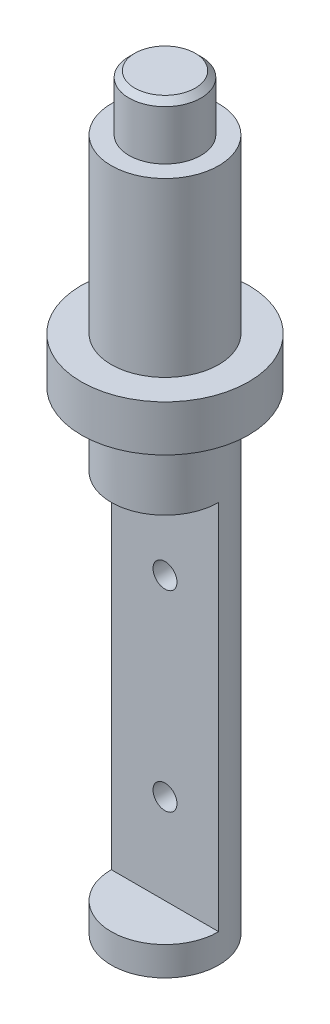
ISO-10303-21;
HEADER;
FILE_DESCRIPTION(('STEP AP214'),'2;1');
FILE_NAME('part.step','',(''),(''),'','','');
FILE_SCHEMA(('AUTOMOTIVE_DESIGN { 1 0 10303 214 1 1 1 1 }'));
ENDSEC;
DATA;
#1=APPLICATION_CONTEXT('core data for automotive mechanical design processes');
#2=APPLICATION_PROTOCOL_DEFINITION('international standard','automotive_design',2000,#1);
#3=PRODUCT_CONTEXT('',#1,'mechanical');
#4=PRODUCT('Part','Part','',(#3));
#5=PRODUCT_RELATED_PRODUCT_CATEGORY('part','',(#4));
#6=PRODUCT_DEFINITION_FORMATION('','',#4);
#7=PRODUCT_DEFINITION_CONTEXT('part definition',#1,'design');
#8=PRODUCT_DEFINITION('design','',#6,#7);
#9=PRODUCT_DEFINITION_SHAPE('','',#8);
#10=(LENGTH_UNIT() NAMED_UNIT(*) SI_UNIT(.MILLI.,.METRE.));
#11=(NAMED_UNIT(*) PLANE_ANGLE_UNIT() SI_UNIT($,.RADIAN.));
#12=(NAMED_UNIT(*) SI_UNIT($,.STERADIAN.) SOLID_ANGLE_UNIT());
#13=UNCERTAINTY_MEASURE_WITH_UNIT(LENGTH_MEASURE(1.E-05),#10,'distance_accuracy_value','');
#14=(GEOMETRIC_REPRESENTATION_CONTEXT(3) GLOBAL_UNCERTAINTY_ASSIGNED_CONTEXT((#13)) GLOBAL_UNIT_ASSIGNED_CONTEXT((#10,
#11,#12)) REPRESENTATION_CONTEXT('',''));
#15=CARTESIAN_POINT('',(0.,0.,0.));
#16=DIRECTION('',(0.,0.,1.));
#17=DIRECTION('',(1.,0.,0.));
#18=AXIS2_PLACEMENT_3D('',#15,#16,#17);
#19=CARTESIAN_POINT('',(0.,-118.7,0.));
#20=DIRECTION('',(0.,1.,0.));
#21=DIRECTION('',(0.,0.,1.));
#22=AXIS2_PLACEMENT_3D('',#19,#20,#21);
#23=CYLINDRICAL_SURFACE('',#22,28.);
#24=CARTESIAN_POINT('',(0.,-118.7,0.));
#25=DIRECTION('',(0.,-1.,0.));
#26=DIRECTION('',(0.,0.,-1.));
#27=AXIS2_PLACEMENT_3D('',#24,#25,#26);
#28=CIRCLE('',#27,28.);
#29=CARTESIAN_POINT('',(0.,-118.7,-28.));
#30=VERTEX_POINT('',#29);
#31=EDGE_CURVE('E108',#30,#30,#28,.F.);
#32=ORIENTED_EDGE('',*,*,#31,.T.);
#33=EDGE_LOOP('',(#32));
#34=FACE_BOUND('',#33,.T.);
#35=CARTESIAN_POINT('',(0.,-28.9,0.));
#36=DIRECTION('',(0.,1.,0.));
#37=DIRECTION('',(0.,0.,1.));
#38=AXIS2_PLACEMENT_3D('',#35,#36,#37);
#39=CIRCLE('',#38,28.);
#40=CARTESIAN_POINT('',(0.,-28.9,28.));
#41=VERTEX_POINT('',#40);
#42=EDGE_CURVE('E104',#41,#41,#39,.T.);
#43=ORIENTED_EDGE('',*,*,#42,.F.);
#44=EDGE_LOOP('',(#43));
#45=FACE_BOUND('',#44,.T.);
#46=ADVANCED_FACE('F33',(#34,#45),#23,.T.);
#47=CARTESIAN_POINT('',(0.,-142.7,0.));
#48=DIRECTION('',(0.,1.,0.));
#49=DIRECTION('',(0.,0.,1.));
#50=AXIS2_PLACEMENT_3D('',#47,#48,#49);
#51=CYLINDRICAL_SURFACE('',#50,43.6);
#52=CARTESIAN_POINT('',(0.,-142.7,0.));
#53=DIRECTION('',(0.,-1.,0.));
#54=DIRECTION('',(0.,0.,-1.));
#55=AXIS2_PLACEMENT_3D('',#52,#53,#54);
#56=CIRCLE('',#55,43.6);
#57=CARTESIAN_POINT('',(0.,-142.7,-43.6));
#58=VERTEX_POINT('',#57);
#59=EDGE_CURVE('E111',#58,#58,#56,.T.);
#60=ORIENTED_EDGE('',*,*,#59,.F.);
#61=EDGE_LOOP('',(#60));
#62=FACE_BOUND('',#61,.T.);
#63=CARTESIAN_POINT('',(0.,-118.7,0.));
#64=DIRECTION('',(0.,-1.,0.));
#65=DIRECTION('',(0.,0.,-1.));
#66=AXIS2_PLACEMENT_3D('',#63,#64,#65);
#67=CIRCLE('',#66,43.6);
#68=CARTESIAN_POINT('',(0.,-118.7,-43.6));
#69=VERTEX_POINT('',#68);
#70=EDGE_CURVE('E112',#69,#69,#67,.T.);
#71=ORIENTED_EDGE('',*,*,#70,.T.);
#72=EDGE_LOOP('',(#71));
#73=FACE_BOUND('',#72,.T.);
#74=ADVANCED_FACE('F123',(#62,#73),#51,.T.);
#75=CARTESIAN_POINT('',(0.,-142.7,0.));
#76=DIRECTION('',(0.,-1.,0.));
#77=DIRECTION('',(0.,0.,-1.));
#78=AXIS2_PLACEMENT_3D('',#75,#76,#77);
#79=PLANE('',#78);
#80=CARTESIAN_POINT('',(0.,-142.7,0.));
#81=DIRECTION('',(0.,-1.,0.));
#82=DIRECTION('',(0.,0.,-1.));
#83=AXIS2_PLACEMENT_3D('',#80,#81,#82);
#84=CIRCLE('',#83,28.);
#85=CARTESIAN_POINT('',(0.,-142.7,-28.));
#86=VERTEX_POINT('',#85);
#87=EDGE_CURVE('E89',#86,#86,#84,.T.);
#88=ORIENTED_EDGE('',*,*,#87,.F.);
#89=EDGE_LOOP('',(#88));
#90=FACE_BOUND('',#89,.T.);
#91=ORIENTED_EDGE('',*,*,#59,.T.);
#92=EDGE_LOOP('',(#91));
#93=FACE_BOUND('',#92,.T.);
#94=ADVANCED_FACE('F128',(#90,#93),#79,.T.);
#95=CARTESIAN_POINT('',(0.,-118.7,0.));
#96=DIRECTION('',(0.,-1.,0.));
#97=DIRECTION('',(0.,0.,-1.));
#98=AXIS2_PLACEMENT_3D('',#95,#96,#97);
#99=PLANE('',#98);
#100=ORIENTED_EDGE('',*,*,#31,.F.);
#101=EDGE_LOOP('',(#100));
#102=FACE_BOUND('',#101,.T.);
#103=ORIENTED_EDGE('',*,*,#70,.F.);
#104=EDGE_LOOP('',(#103));
#105=FACE_BOUND('',#104,.T.);
#106=ADVANCED_FACE('F137',(#102,#105),#99,.F.);
#107=CARTESIAN_POINT('',(0.,-28.9,0.));
#108=DIRECTION('',(0.,1.,0.));
#109=DIRECTION('',(0.,0.,1.));
#110=AXIS2_PLACEMENT_3D('',#107,#108,#109);
#111=PLANE('',#110);
#112=CARTESIAN_POINT('',(0.,-28.9,0.));
#113=DIRECTION('',(0.,1.,0.));
#114=DIRECTION('',(0.,0.,1.));
#115=AXIS2_PLACEMENT_3D('',#112,#113,#114);
#116=CIRCLE('',#115,18.75);
#117=CARTESIAN_POINT('',(0.,-28.9,18.75));
#118=VERTEX_POINT('',#117);
#119=EDGE_CURVE('E102',#118,#118,#116,.T.);
#120=ORIENTED_EDGE('',*,*,#119,.F.);
#121=EDGE_LOOP('',(#120));
#122=FACE_BOUND('',#121,.T.);
#123=ORIENTED_EDGE('',*,*,#42,.T.);
#124=EDGE_LOOP('',(#123));
#125=FACE_BOUND('',#124,.T.);
#126=ADVANCED_FACE('F120',(#122,#125),#111,.T.);
#127=CARTESIAN_POINT('',(0.,-28.9,0.));
#128=DIRECTION('',(0.,1.,0.));
#129=DIRECTION('',(0.,0.,1.));
#130=AXIS2_PLACEMENT_3D('',#127,#128,#129);
#131=CYLINDRICAL_SURFACE('',#130,18.75);
#132=CARTESIAN_POINT('',(0.,-3.00000000000003,0.));
#133=DIRECTION('',(0.,1.,0.));
#134=DIRECTION('',(0.,0.,1.));
#135=AXIS2_PLACEMENT_3D('',#132,#133,#134);
#136=CIRCLE('',#135,18.75);
#137=CARTESIAN_POINT('',(0.,-3.00000000000003,18.75));
#138=VERTEX_POINT('',#137);
#139=EDGE_CURVE('E11',#138,#138,#136,.F.);
#140=ORIENTED_EDGE('',*,*,#139,.T.);
#141=EDGE_LOOP('',(#140));
#142=FACE_BOUND('',#141,.T.);
#143=ORIENTED_EDGE('',*,*,#119,.T.);
#144=EDGE_LOOP('',(#143));
#145=FACE_BOUND('',#144,.T.);
#146=ADVANCED_FACE('F134',(#142,#145),#131,.T.);
#147=CARTESIAN_POINT('',(0.,0.,0.));
#148=DIRECTION('',(0.,1.,0.));
#149=DIRECTION('',(0.,0.,1.));
#150=AXIS2_PLACEMENT_3D('',#147,#148,#149);
#151=PLANE('',#150);
#152=CARTESIAN_POINT('',(0.,0.,0.));
#153=DIRECTION('',(0.,1.,0.));
#154=DIRECTION('',(0.,0.,1.));
#155=AXIS2_PLACEMENT_3D('',#152,#153,#154);
#156=CIRCLE('',#155,15.75);
#157=CARTESIAN_POINT('',(0.,0.,15.75));
#158=VERTEX_POINT('',#157);
#159=EDGE_CURVE('E43',#158,#158,#156,.T.);
#160=ORIENTED_EDGE('',*,*,#159,.T.);
#161=EDGE_LOOP('',(#160));
#162=FACE_BOUND('',#161,.T.);
#163=ADVANCED_FACE('F132',(#162),#151,.T.);
#164=CARTESIAN_POINT('',(0.,0.,0.));
#165=DIRECTION('',(0.,-1.,0.));
#166=DIRECTION('',(0.,0.,-1.));
#167=AXIS2_PLACEMENT_3D('',#164,#165,#166);
#168=CONICAL_SURFACE('',#167,15.75,0.785398163397447);
#169=ORIENTED_EDGE('',*,*,#139,.F.);
#170=EDGE_LOOP('',(#169));
#171=FACE_BOUND('',#170,.T.);
#172=ORIENTED_EDGE('',*,*,#159,.F.);
#173=EDGE_LOOP('',(#172));
#174=FACE_BOUND('',#173,.T.);
#175=ADVANCED_FACE('F35',(#171,#174),#168,.T.);
#176=CARTESIAN_POINT('',(0.,-180.9,0.));
#177=DIRECTION('',(0.,1.,0.));
#178=DIRECTION('',(0.,0.,1.));
#179=AXIS2_PLACEMENT_3D('',#176,#177,#178);
#180=CYLINDRICAL_SURFACE('',#179,28.);
#181=CARTESIAN_POINT('',(6.25000000000104,-327.8,-27.293543192484));
#182=CARTESIAN_POINT('',(6.25000418094577,-327.626772759869,-27.2935406630596));
#183=CARTESIAN_POINT('',(6.24279659776713,-327.453594583877,-27.2951952944759));
#184=CARTESIAN_POINT('',(6.2140344035094,-327.108445204921,-27.3017584796591));
#185=CARTESIAN_POINT('',(6.19247770552379,-326.9364741812,-27.3066675067384));
#186=CARTESIAN_POINT('',(6.13517608335094,-326.594963014681,-27.3195986301186));
#187=CARTESIAN_POINT('',(6.0994250119821,-326.425423958102,-27.3276220751523));
#188=CARTESIAN_POINT('',(6.01400967245224,-326.089985283219,-27.3465464155527));
#189=CARTESIAN_POINT('',(5.96434027209,-325.924087031793,-27.357448372247));
#190=CARTESIAN_POINT('',(5.85156924300213,-325.59739823919,-27.381790591684));
#191=CARTESIAN_POINT('',(5.78848806167902,-325.436600346177,-27.3952269869801));
#192=CARTESIAN_POINT('',(5.64929956777919,-325.120879039308,-27.4242678496654));
#193=CARTESIAN_POINT('',(5.57318744653439,-324.965957819931,-27.4398731170086));
#194=CARTESIAN_POINT('',(5.40853934346006,-324.663139675886,-27.472800071714));
#195=CARTESIAN_POINT('',(5.32000839111495,-324.515239939892,-27.4901210633971));
#196=CARTESIAN_POINT('',(5.13108281812698,-324.227304807542,-27.5260101395212));
#197=CARTESIAN_POINT('',(5.03068375356174,-324.087272386179,-27.5445786899704));
#198=CARTESIAN_POINT('',(4.81708795276463,-323.813935535353,-27.5827411710543));
#199=CARTESIAN_POINT('',(4.70371753740285,-323.680768388947,-27.6023465077545));
#200=CARTESIAN_POINT('',(4.4661944299133,-323.424367602939,-27.6417727676249));
#201=CARTESIAN_POINT('',(4.34203775433329,-323.301137665901,-27.6615937680573));
#202=CARTESIAN_POINT('',(4.08384197537849,-323.065523242344,-27.7008894748949));
#203=CARTESIAN_POINT('',(3.94980570128983,-322.953135671949,-27.7203642784751));
#204=CARTESIAN_POINT('',(3.67265674935739,-322.739893741983,-27.7584430824458));
#205=CARTESIAN_POINT('',(3.52954074575733,-322.639043646761,-27.7770467593694));
#206=CARTESIAN_POINT('',(3.23365995739682,-322.448624564621,-27.8130523460939));
#207=CARTESIAN_POINT('',(3.08080874634106,-322.359186955487,-27.8304393713551));
#208=CARTESIAN_POINT('',(2.76785167600587,-322.193497928413,-27.8633050823481));
#209=CARTESIAN_POINT('',(2.60774311456769,-322.117251473738,-27.8787830491572));
#210=CARTESIAN_POINT('',(2.28150107379556,-321.978606172387,-27.9073737582623));
#211=CARTESIAN_POINT('',(2.11537041669255,-321.916200934247,-27.9204875917192));
#212=CARTESIAN_POINT('',(1.77823756424074,-321.80567560503,-27.9439896454641));
#213=CARTESIAN_POINT('',(1.60723363283278,-321.757560676261,-27.9543768806238));
#214=CARTESIAN_POINT('',(1.09439758323778,-321.636694005375,-27.9806601200355));
#215=CARTESIAN_POINT('',(0.746994222028701,-321.584988483422,-27.9921960538676));
#216=CARTESIAN_POINT('',(0.223520525140103,-321.551534661022,-27.9996585490209));
#217=CARTESIAN_POINT('',(0.0485642360956089,-321.547741429726,-28.0005041840467));
#218=CARTESIAN_POINT('',(-0.301058844424878,-321.554808971572,-27.9989265851302));
#219=CARTESIAN_POINT('',(-0.47572563183415,-321.565669948848,-27.9965033056516));
#220=CARTESIAN_POINT('',(-0.99108097044849,-321.619554977227,-27.9845298925051));
#221=CARTESIAN_POINT('',(-1.32971272514877,-321.683476976027,-27.9703645197021));
#222=CARTESIAN_POINT('',(-1.99113945055409,-321.865716376935,-27.931083948751));
#223=CARTESIAN_POINT('',(-2.31393368526145,-321.984036304365,-27.9059682422567));
#224=CARTESIAN_POINT('',(-2.93758195962086,-322.272613693557,-27.8472521946707));
#225=CARTESIAN_POINT('',(-3.23825157149031,-322.443257248304,-27.8135891116372));
#226=CARTESIAN_POINT('',(-3.80704732566682,-322.831348644581,-27.7414625355305));
#227=CARTESIAN_POINT('',(-4.07516885533259,-323.048803107967,-27.7029983636207));
#228=CARTESIAN_POINT('',(-4.57738580559778,-323.529924683463,-27.6245113562131));
#229=CARTESIAN_POINT('',(-4.81061849864692,-323.794490686192,-27.5844728055817));
#230=CARTESIAN_POINT('',(-5.22957036099659,-324.359395719265,-27.5081274935846));
#231=CARTESIAN_POINT('',(-5.41528813197619,-324.659735802028,-27.471820842064));
#232=CARTESIAN_POINT('',(-5.73434528879771,-325.28909832967,-27.4070063654908));
#233=CARTESIAN_POINT('',(-5.86751562740479,-325.618209250125,-27.378523798695));
#234=CARTESIAN_POINT('',(-6.07639622505545,-326.294926272324,-27.3329281069132));
#235=CARTESIAN_POINT('',(-6.15211601866699,-326.642529294842,-27.3158130954116));
#236=CARTESIAN_POINT('',(-6.24259542089337,-327.338463469748,-27.2952766976969));
#237=CARTESIAN_POINT('',(-6.25861396727066,-327.686622794773,-27.2915725610693));
#238=CARTESIAN_POINT('',(-6.23264970128998,-328.380637266418,-27.2975136372095));
#239=CARTESIAN_POINT('',(-6.19067105243353,-328.726492576648,-27.3071578917235));
#240=CARTESIAN_POINT('',(-6.05099829572543,-329.401658787116,-27.3384415167489));
#241=CARTESIAN_POINT('',(-5.95400289682856,-329.731121853203,-27.3599303668857));
#242=CARTESIAN_POINT('',(-5.70780773520766,-330.369119561196,-27.4123452195026));
#243=CARTESIAN_POINT('',(-5.5586028064809,-330.677652128473,-27.4432721558192));
#244=CARTESIAN_POINT('',(-5.20947386615113,-331.270462153433,-27.5116960387509));
#245=CARTESIAN_POINT('',(-5.00877748022519,-331.554273239041,-27.5492900747219));
#246=CARTESIAN_POINT('',(-4.56335143969514,-332.084653800083,-27.6265592430675));
#247=CARTESIAN_POINT('',(-4.31861607865781,-332.331218441614,-27.6662346446663));
#248=CARTESIAN_POINT('',(-3.78641602647932,-332.78500466893,-27.7441297258465));
#249=CARTESIAN_POINT('',(-3.49821158905043,-332.99136592114,-27.7823059698254));
#250=CARTESIAN_POINT('',(-2.89029963896299,-333.352791761544,-27.8520981732883));
#251=CARTESIAN_POINT('',(-2.57059362989431,-333.507858796504,-27.8837144456602));
#252=CARTESIAN_POINT('',(-2.07570333708386,-333.697887719815,-27.9234467514473));
#253=CARTESIAN_POINT('',(-1.90866854996581,-333.754038169116,-27.9353862929347));
#254=CARTESIAN_POINT('',(-1.57030628340904,-333.852074197087,-27.9564443638962));
#255=CARTESIAN_POINT('',(-1.39898042234049,-333.893965069283,-27.965563940099));
#256=CARTESIAN_POINT('',(-1.0532683157328,-333.963133940246,-27.9807181181668));
#257=CARTESIAN_POINT('',(-0.878881858443611,-333.990410923789,-27.986752505703));
#258=CARTESIAN_POINT('',(-0.528347318501267,-334.030124734713,-27.9955635060914));
#259=CARTESIAN_POINT('',(-0.352199306559219,-334.042562155382,-27.9983402491844));
#260=CARTESIAN_POINT('',(-0.00328258899816175,-334.052382704856,-28.0005315872801));
#261=CARTESIAN_POINT('',(0.169476763449839,-334.050085760547,-28.0000176335599));
#262=CARTESIAN_POINT('',(0.514171279856359,-334.031205252523,-27.995809223028));
#263=CARTESIAN_POINT('',(0.686106460538437,-334.014621979942,-27.9921148310289));
#264=CARTESIAN_POINT('',(1.02794898351345,-333.967300889138,-27.9816470037884));
#265=CARTESIAN_POINT('',(1.19785600193919,-333.936560840508,-27.9748730833677));
#266=CARTESIAN_POINT('',(1.53435186906374,-333.861186498783,-27.9584357777394));
#267=CARTESIAN_POINT('',(1.70094187555886,-333.816557147495,-27.9487734202847));
#268=CARTESIAN_POINT('',(2.02918872938559,-333.71391333612,-27.9268574568711));
#269=CARTESIAN_POINT('',(2.19085948233623,-333.655941549387,-27.914612122305));
#270=CARTESIAN_POINT('',(2.50866639727943,-333.526996614568,-27.8878471112106));
#271=CARTESIAN_POINT('',(2.66480448180391,-333.456028036642,-27.8733282344043));
#272=CARTESIAN_POINT('',(2.97063998638493,-333.301559769507,-27.8423945526456));
#273=CARTESIAN_POINT('',(3.12033463343445,-333.218054753125,-27.8259789423909));
#274=CARTESIAN_POINT('',(3.41219288944396,-333.039153331803,-27.7916988602937));
#275=CARTESIAN_POINT('',(3.5543590181536,-332.943760941799,-27.7738348783442));
#276=CARTESIAN_POINT('',(3.83307740152987,-332.739680676552,-27.7367568229684));
#277=CARTESIAN_POINT('',(3.96945995543685,-332.630764581969,-27.7175228620526));
#278=CARTESIAN_POINT('',(4.23255724998666,-332.401992902721,-27.6785682794898));
#279=CARTESIAN_POINT('',(4.35927532337034,-332.282141120766,-27.6588478287392));
#280=CARTESIAN_POINT('',(4.60233284521576,-332.032190697746,-27.6194442852868));
#281=CARTESIAN_POINT('',(4.7186660251485,-331.902085955803,-27.5997612220744));
#282=CARTESIAN_POINT('',(4.94004645388501,-331.632602018594,-27.5609972321726));
#283=CARTESIAN_POINT('',(5.04509781049926,-331.493226229135,-27.5419160881186));
#284=CARTESIAN_POINT('',(5.24467646780709,-331.203995171382,-27.5046146614127));
#285=CARTESIAN_POINT('',(5.33902953184734,-331.054017467704,-27.4864108262581));
#286=CARTESIAN_POINT('',(5.51470510633791,-330.746502220708,-27.4517038520393));
#287=CARTESIAN_POINT('',(5.59603241561559,-330.588967489404,-27.4352000874542));
#288=CARTESIAN_POINT('',(5.74504238460841,-330.267459281152,-27.4043843599852));
#289=CARTESIAN_POINT('',(5.81273237339943,-330.103489319597,-27.3900712207974));
#290=CARTESIAN_POINT('',(5.93397254806194,-329.77025885759,-27.3640603447368));
#291=CARTESIAN_POINT('',(5.98752522004007,-329.6009992932,-27.3523621480709));
#292=CARTESIAN_POINT('',(6.10534932009802,-329.164711263261,-27.3263643748794));
#293=CARTESIAN_POINT('',(6.15951030297612,-328.894756275629,-27.3141314337924));
#294=CARTESIAN_POINT('',(6.23183137429584,-328.349826175448,-27.2977230622743));
#295=CARTESIAN_POINT('',(6.24999336629716,-328.074851329116,-27.2935472057999));
#296=CARTESIAN_POINT('',(6.25000000000104,-327.8,-27.293543192484));
#297=B_SPLINE_CURVE_WITH_KNOTS('',3,(#181,#182,#183,#184,#185,#186,#187,#188,#189,#190,#191,
#192,#193,#194,#195,#196,#197,#198,#199,#200,#201,#202,#203,#204,#205,#206,#207,#208,#209,#210,
#211,#212,#213,#214,#215,#216,#217,#218,#219,#220,#221,#222,#223,#224,#225,#226,#227,#228,#229,
#230,#231,#232,#233,#234,#235,#236,#237,#238,#239,#240,#241,#242,#243,#244,#245,#246,#247,#248,
#249,#250,#251,#252,#253,#254,#255,#256,#257,#258,#259,#260,#261,#262,#263,#264,#265,#266,#267,
#268,#269,#270,#271,#272,#273,#274,#275,#276,#277,#278,#279,#280,#281,#282,#283,#284,#285,#286,
#287,#288,#289,#290,#291,#292,#293,#294,#295,#296),.UNSPECIFIED.,.T.,.F.,(4,2,2,2,2,2,2,2,2,2,2,
2,2,2,2,2,2,2,2,2,2,2,2,2,2,2,2,2,2,2,2,2,2,2,2,2,2,2,2,2,2,2,2,2,2,2,2,2,2,2,2,2,2,2,2,2,2,4),
(0.,0.519439608500111,1.03895477976747,1.55869518419967,2.07862748884639,2.5977727248206,
3.11710994995217,3.6362374534396,4.15555995961564,4.68290174643603,5.21043911948484,
5.73782600077031,6.26540718315177,6.79859906273959,7.33199112529032,7.86513636801499,
8.39847397341278,9.44659898859374,9.97108019976343,10.4955687170816,11.5250017072293,
12.5544824917318,13.5917504134608,14.6291651632887,15.6890487552905,16.7489635351156,
17.8122608342571,18.8753816285583,19.9159529707267,20.9564496162611,21.9840187566687,
23.0116896012438,24.0557822772238,25.10001034103,26.1645877935077,27.229114457624,
27.7584522517356,28.2875933270914,28.8167711569939,29.3459278295956,29.8636344148691,
30.3813304503265,30.8991080770091,31.4167016888243,31.9326623270648,32.4484418813474,
32.9644412321528,33.4802667751747,34.0064342303606,34.5324194115064,35.0587199707588,
35.5848282449849,36.1185476697549,36.6520700120354,37.1853048551526,37.7184458641198,
38.5426592882079,39.3668291282596),.UNSPECIFIED.);
#298=CARTESIAN_POINT('',(6.25000000000104,-327.8,-27.293543192484));
#299=VERTEX_POINT('',#298);
#300=EDGE_CURVE('E162',#299,#299,#297,.T.);
#301=ORIENTED_EDGE('',*,*,#300,.T.);
#302=EDGE_LOOP('',(#301));
#303=FACE_BOUND('',#302,.T.);
#304=CARTESIAN_POINT('',(6.25000000000001,-227.8,-27.2935431924842));
#305=CARTESIAN_POINT('',(6.25000418094473,-227.626772759869,-27.2935406630598));
#306=CARTESIAN_POINT('',(6.24279659776609,-227.453594583877,-27.2951952944761));
#307=CARTESIAN_POINT('',(6.21403440350836,-227.108445204921,-27.3017584796593));
#308=CARTESIAN_POINT('',(6.19247770552276,-226.9364741812,-27.3066675067386));
#309=CARTESIAN_POINT('',(6.13517608334991,-226.594963014681,-27.3195986301189));
#310=CARTESIAN_POINT('',(6.09942501198106,-226.425423958102,-27.3276220751525));
#311=CARTESIAN_POINT('',(6.01400967245121,-226.089985283219,-27.3465464155529));
#312=CARTESIAN_POINT('',(5.96434027208898,-225.924087031793,-27.3574483722472));
#313=CARTESIAN_POINT('',(5.85156924300111,-225.59739823919,-27.3817905916842));
#314=CARTESIAN_POINT('',(5.78848806167799,-225.436600346177,-27.3952269869803));
#315=CARTESIAN_POINT('',(5.64929956777816,-225.120879039308,-27.4242678496656));
#316=CARTESIAN_POINT('',(5.57318744653335,-224.965957819931,-27.4398731170088));
#317=CARTESIAN_POINT('',(5.40853934345902,-224.663139675886,-27.4728000717142));
#318=CARTESIAN_POINT('',(5.32000839111391,-224.515239939892,-27.4901210633973));
#319=CARTESIAN_POINT('',(5.13108281812593,-224.227304807542,-27.5260101395214));
#320=CARTESIAN_POINT('',(5.0306837535607,-224.087272386179,-27.5445786899706));
#321=CARTESIAN_POINT('',(4.81708795276359,-223.813935535353,-27.5827411710545));
#322=CARTESIAN_POINT('',(4.7037175374018,-223.680768388947,-27.6023465077547));
#323=CARTESIAN_POINT('',(4.46619442991226,-223.424367602939,-27.6417727676251));
#324=CARTESIAN_POINT('',(4.34203775433226,-223.301137665901,-27.6615937680575));
#325=CARTESIAN_POINT('',(4.08384197537748,-223.065523242344,-27.7008894748951));
#326=CARTESIAN_POINT('',(3.94980570128882,-222.953135671949,-27.7203642784753));
#327=CARTESIAN_POINT('',(3.67265674935639,-222.739893741984,-27.7584430824459));
#328=CARTESIAN_POINT('',(3.52954074575633,-222.639043646761,-27.7770467593696));
#329=CARTESIAN_POINT('',(3.2336599573958,-222.448624564621,-27.813052346094));
#330=CARTESIAN_POINT('',(3.08080874634004,-222.359186955487,-27.8304393713552));
#331=CARTESIAN_POINT('',(2.76785167600485,-222.193497928413,-27.8633050823482));
#332=CARTESIAN_POINT('',(2.60774311456667,-222.117251473738,-27.8787830491573));
#333=CARTESIAN_POINT('',(2.28150107379454,-221.978606172387,-27.9073737582624));
#334=CARTESIAN_POINT('',(2.11537041669153,-221.916200934247,-27.9204875917193));
#335=CARTESIAN_POINT('',(1.77823756423972,-221.80567560503,-27.9439896454641));
#336=CARTESIAN_POINT('',(1.60723363283176,-221.757560676261,-27.9543768806238));
#337=CARTESIAN_POINT('',(1.09439758323677,-221.636694005375,-27.9806601200355));
#338=CARTESIAN_POINT('',(0.746994222027697,-221.584988483422,-27.9921960538677));
#339=CARTESIAN_POINT('',(0.223520525139105,-221.551534661022,-27.9996585490209));
#340=CARTESIAN_POINT('',(0.0485642360946124,-221.547741429726,-28.0005041840467));
#341=CARTESIAN_POINT('',(-0.301058844425871,-221.554808971572,-27.9989265851302));
#342=CARTESIAN_POINT('',(-0.475725631835141,-221.565669948848,-27.9965033056516));
#343=CARTESIAN_POINT('',(-0.991080970449482,-221.619554977227,-27.9845298925051));
#344=CARTESIAN_POINT('',(-1.32971272514976,-221.683476976027,-27.970364519702));
#345=CARTESIAN_POINT('',(-1.99113945055509,-221.865716376935,-27.9310839487509));
#346=CARTESIAN_POINT('',(-2.31393368526245,-221.984036304365,-27.9059682422566));
#347=CARTESIAN_POINT('',(-2.93758195962187,-222.272613693557,-27.8472521946706));
#348=CARTESIAN_POINT('',(-3.23825157149131,-222.443257248304,-27.8135891116371));
#349=CARTESIAN_POINT('',(-3.80704732566783,-222.831348644581,-27.7414625355304));
#350=CARTESIAN_POINT('',(-4.07516885533361,-223.048803107967,-27.7029983636206));
#351=CARTESIAN_POINT('',(-4.57738580559882,-223.529924683463,-27.6245113562129));
#352=CARTESIAN_POINT('',(-4.81061849864797,-223.794490686192,-27.5844728055815));
#353=CARTESIAN_POINT('',(-5.22957036099764,-224.359395719265,-27.5081274935844));
#354=CARTESIAN_POINT('',(-5.41528813197723,-224.659735802028,-27.4718208420638));
#355=CARTESIAN_POINT('',(-5.73434528879876,-225.28909832967,-27.4070063654906));
#356=CARTESIAN_POINT('',(-5.86751562740584,-225.618209250125,-27.3785237986948));
#357=CARTESIAN_POINT('',(-6.07639622505651,-226.294926272324,-27.332928106913));
#358=CARTESIAN_POINT('',(-6.15211601866805,-226.642529294842,-27.3158130954113));
#359=CARTESIAN_POINT('',(-6.24259542089443,-227.338463469748,-27.2952766976967));
#360=CARTESIAN_POINT('',(-6.25861396727173,-227.686622794773,-27.291572561069));
#361=CARTESIAN_POINT('',(-6.23264970129105,-228.380637266418,-27.2975136372093));
#362=CARTESIAN_POINT('',(-6.1906710524346,-228.726492576648,-27.3071578917233));
#363=CARTESIAN_POINT('',(-6.05099829572652,-229.401658787116,-27.3384415167487));
#364=CARTESIAN_POINT('',(-5.95400289682965,-229.731121853203,-27.3599303668854));
#365=CARTESIAN_POINT('',(-5.70780773520875,-230.369119561196,-27.4123452195024));
#366=CARTESIAN_POINT('',(-5.558602806482,-230.677652128473,-27.443272155819));
#367=CARTESIAN_POINT('',(-5.20947386615226,-231.270462153433,-27.5116960387507));
#368=CARTESIAN_POINT('',(-5.00877748022632,-231.55427323904,-27.5492900747217));
#369=CARTESIAN_POINT('',(-4.56335143969627,-232.084653800083,-27.6265592430673));
#370=CARTESIAN_POINT('',(-4.31861607865892,-232.331218441614,-27.6662346446662));
#371=CARTESIAN_POINT('',(-3.78641602648043,-232.78500466893,-27.7441297258463));
#372=CARTESIAN_POINT('',(-3.49821158905155,-232.99136592114,-27.7823059698253));
#373=CARTESIAN_POINT('',(-2.89029963896412,-233.352791761544,-27.8520981732881));
#374=CARTESIAN_POINT('',(-2.57059362989546,-233.507858796504,-27.8837144456601));
#375=CARTESIAN_POINT('',(-2.07570333708501,-233.697887719815,-27.9234467514472));
#376=CARTESIAN_POINT('',(-1.90866854996696,-233.754038169116,-27.9353862929346));
#377=CARTESIAN_POINT('',(-1.57030628341018,-233.852074197087,-27.9564443638961));
#378=CARTESIAN_POINT('',(-1.39898042234162,-233.893965069283,-27.9655639400989));
#379=CARTESIAN_POINT('',(-1.05326831573392,-233.963133940246,-27.9807181181667));
#380=CARTESIAN_POINT('',(-0.878881858444732,-233.990410923789,-27.986752505703));
#381=CARTESIAN_POINT('',(-0.528347318502384,-234.030124734713,-27.9955635060914));
#382=CARTESIAN_POINT('',(-0.352199306560334,-234.042562155382,-27.9983402491844));
#383=CARTESIAN_POINT('',(-0.0032825889992732,-234.052382704856,-28.0005315872801));
#384=CARTESIAN_POINT('',(0.169476763448729,-234.050085760547,-28.0000176335599));
#385=CARTESIAN_POINT('',(0.51417127985525,-234.031205252523,-27.9958092230281));
#386=CARTESIAN_POINT('',(0.686106460537328,-234.014621979942,-27.992114831029));
#387=CARTESIAN_POINT('',(1.02794898351234,-233.967300889138,-27.9816470037885));
#388=CARTESIAN_POINT('',(1.19785600193809,-233.936560840508,-27.9748730833678));
#389=CARTESIAN_POINT('',(1.53435186906264,-233.861186498783,-27.9584357777394));
#390=CARTESIAN_POINT('',(1.70094187555776,-233.816557147495,-27.9487734202847));
#391=CARTESIAN_POINT('',(2.02918872938449,-233.71391333612,-27.9268574568712));
#392=CARTESIAN_POINT('',(2.19085948233514,-233.655941549387,-27.9146121223051));
#393=CARTESIAN_POINT('',(2.50866639727833,-233.526996614569,-27.8878471112107));
#394=CARTESIAN_POINT('',(2.66480448180281,-233.456028036642,-27.8733282344044));
#395=CARTESIAN_POINT('',(2.97063998638384,-233.301559769507,-27.8423945526458));
#396=CARTESIAN_POINT('',(3.12033463343336,-233.218054753125,-27.825978942391));
#397=CARTESIAN_POINT('',(3.41219288944288,-233.039153331803,-27.7916988602938));
#398=CARTESIAN_POINT('',(3.55435901815253,-232.943760941799,-27.7738348783443));
#399=CARTESIAN_POINT('',(3.8330774015288,-232.739680676553,-27.7367568229686));
#400=CARTESIAN_POINT('',(3.96945995543578,-232.63076458197,-27.7175228620528));
#401=CARTESIAN_POINT('',(4.23255724998558,-232.401992902721,-27.67856827949));
#402=CARTESIAN_POINT('',(4.35927532336926,-232.282141120766,-27.6588478287394));
#403=CARTESIAN_POINT('',(4.60233284521468,-232.032190697746,-27.619444285287));
#404=CARTESIAN_POINT('',(4.71866602514744,-231.902085955803,-27.5997612220746));
#405=CARTESIAN_POINT('',(4.94004645388396,-231.632602018594,-27.5609972321728));
#406=CARTESIAN_POINT('',(5.0450978104982,-231.493226229136,-27.5419160881187));
#407=CARTESIAN_POINT('',(5.24467646780603,-231.203995171382,-27.5046146614129));
#408=CARTESIAN_POINT('',(5.33902953184629,-231.054017467704,-27.4864108262583));
#409=CARTESIAN_POINT('',(5.51470510633686,-230.746502220708,-27.4517038520395));
#410=CARTESIAN_POINT('',(5.59603241561453,-230.588967489404,-27.4352000874544));
#411=CARTESIAN_POINT('',(5.74504238460736,-230.267459281153,-27.4043843599854));
#412=CARTESIAN_POINT('',(5.81273237339837,-230.103489319597,-27.3900712207976));
#413=CARTESIAN_POINT('',(5.93397254806088,-229.77025885759,-27.3640603447371));
#414=CARTESIAN_POINT('',(5.98752522003901,-229.6009992932,-27.3523621480712));
#415=CARTESIAN_POINT('',(6.10534932009698,-229.164711263261,-27.3263643748797));
#416=CARTESIAN_POINT('',(6.15951030297508,-228.894756275629,-27.3141314337926));
#417=CARTESIAN_POINT('',(6.2318313742948,-228.349826175448,-27.2977230622745));
#418=CARTESIAN_POINT('',(6.24999336629613,-228.074851329116,-27.2935472058002));
#419=CARTESIAN_POINT('',(6.25000000000001,-227.8,-27.2935431924842));
#420=B_SPLINE_CURVE_WITH_KNOTS('',3,(#304,#305,#306,#307,#308,#309,#310,#311,#312,#313,#314,
#315,#316,#317,#318,#319,#320,#321,#322,#323,#324,#325,#326,#327,#328,#329,#330,#331,#332,#333,
#334,#335,#336,#337,#338,#339,#340,#341,#342,#343,#344,#345,#346,#347,#348,#349,#350,#351,#352,
#353,#354,#355,#356,#357,#358,#359,#360,#361,#362,#363,#364,#365,#366,#367,#368,#369,#370,#371,
#372,#373,#374,#375,#376,#377,#378,#379,#380,#381,#382,#383,#384,#385,#386,#387,#388,#389,#390,
#391,#392,#393,#394,#395,#396,#397,#398,#399,#400,#401,#402,#403,#404,#405,#406,#407,#408,#409,
#410,#411,#412,#413,#414,#415,#416,#417,#418,#419),.UNSPECIFIED.,.T.,.F.,(4,2,2,2,2,2,2,2,2,2,2,
2,2,2,2,2,2,2,2,2,2,2,2,2,2,2,2,2,2,2,2,2,2,2,2,2,2,2,2,2,2,2,2,2,2,2,2,2,2,2,2,2,2,2,2,2,2,4),
(0.,0.519439608500139,1.03895477976753,1.55869518419964,2.07862748884636,2.59777272482057,
3.1171099499522,3.63623745343965,4.1555599596157,4.68290174643601,5.21043911948483,
5.73782600077026,6.26540718315175,6.79859906273956,7.33199112529031,7.86513636801498,
8.39847397341276,9.4465989885937,9.97108019976339,10.4955687170816,11.5250017072293,
12.5544824917318,13.5917504134608,14.6291651632887,15.6890487552906,16.7489635351156,
17.8122608342571,18.8753816285583,19.9159529707267,20.9564496162611,21.9840187566687,
23.0116896012437,24.0557822772237,25.10001034103,26.1645877935077,27.229114457624,
27.7584522517355,28.2875933270914,28.8167711569939,29.3459278295956,29.8636344148691,
30.3813304503266,30.8991080770091,31.4167016888243,31.9326623270648,32.4484418813475,
32.9644412321529,33.4802667751747,34.0064342303606,34.5324194115064,35.0587199707588,
35.5848282449849,36.1185476697549,36.6520700120354,37.1853048551527,37.7184458641198,
38.542659288208,39.3668291282597),.UNSPECIFIED.);
#421=CARTESIAN_POINT('',(6.25000000000001,-227.8,-27.2935431924842));
#422=VERTEX_POINT('',#421);
#423=EDGE_CURVE('E76',#422,#422,#420,.T.);
#424=ORIENTED_EDGE('',*,*,#423,.T.);
#425=EDGE_LOOP('',(#424));
#426=FACE_BOUND('',#425,.T.);
#427=CARTESIAN_POINT('',(0.,-180.9,0.));
#428=DIRECTION('',(0.,-1.,0.));
#429=DIRECTION('',(0.,0.,-1.));
#430=AXIS2_PLACEMENT_3D('',#427,#428,#429);
#431=CIRCLE('',#430,28.);
#432=CARTESIAN_POINT('',(28.,-180.9,0.));
#433=VERTEX_POINT('',#432);
#434=CARTESIAN_POINT('',(-28.,-180.9,0.));
#435=VERTEX_POINT('',#434);
#436=EDGE_CURVE('E100',#433,#435,#431,.T.);
#437=ORIENTED_EDGE('',*,*,#436,.F.);
#438=DIRECTION('',(0.,1.,0.));
#439=VECTOR('',#438,1.);
#440=CARTESIAN_POINT('',(28.,-374.7,0.));
#441=LINE('',#440,#439);
#442=CARTESIAN_POINT('',(28.,-374.7,0.));
#443=VERTEX_POINT('',#442);
#444=EDGE_CURVE('E67',#443,#433,#441,.T.);
#445=ORIENTED_EDGE('',*,*,#444,.F.);
#446=CARTESIAN_POINT('',(0.,-374.7,0.));
#447=DIRECTION('',(0.,-1.,0.));
#448=DIRECTION('',(0.,0.,-1.));
#449=AXIS2_PLACEMENT_3D('',#446,#447,#448);
#450=CIRCLE('',#449,28.);
#451=CARTESIAN_POINT('',(-28.,-374.7,0.));
#452=VERTEX_POINT('',#451);
#453=EDGE_CURVE('E72',#443,#452,#450,.T.);
#454=ORIENTED_EDGE('',*,*,#453,.T.);
#455=DIRECTION('',(0.,1.,0.));
#456=VECTOR('',#455,1.);
#457=CARTESIAN_POINT('',(-28.,-374.7,0.));
#458=LINE('',#457,#456);
#459=EDGE_CURVE('E63',#452,#435,#458,.T.);
#460=ORIENTED_EDGE('',*,*,#459,.T.);
#461=EDGE_LOOP('',(#437,#445,#454,#460));
#462=FACE_BOUND('',#461,.T.);
#463=ORIENTED_EDGE('',*,*,#87,.T.);
#464=EDGE_LOOP('',(#463));
#465=FACE_BOUND('',#464,.T.);
#466=CARTESIAN_POINT('',(0.,-389.8,0.));
#467=DIRECTION('',(0.,-1.,0.));
#468=DIRECTION('',(0.,0.,-1.));
#469=AXIS2_PLACEMENT_3D('',#466,#467,#468);
#470=CIRCLE('',#469,28.);
#471=CARTESIAN_POINT('',(0.,-389.8,-28.));
#472=VERTEX_POINT('',#471);
#473=EDGE_CURVE('E75',#472,#472,#470,.T.);
#474=ORIENTED_EDGE('',*,*,#473,.F.);
#475=EDGE_LOOP('',(#474));
#476=FACE_BOUND('',#475,.T.);
#477=ADVANCED_FACE('F73',(#303,#426,#462,#465,#476),#180,.T.);
#478=CARTESIAN_POINT('',(0.,-180.9,0.));
#479=DIRECTION('',(0.,-1.,0.));
#480=DIRECTION('',(0.,0.,-1.));
#481=AXIS2_PLACEMENT_3D('',#478,#479,#480);
#482=PLANE('',#481);
#483=DIRECTION('',(-1.,0.,0.));
#484=VECTOR('',#483,1.);
#485=CARTESIAN_POINT('',(-28.,-180.9,0.));
#486=LINE('',#485,#484);
#487=EDGE_CURVE('E50',#433,#435,#486,.T.);
#488=ORIENTED_EDGE('',*,*,#487,.F.);
#489=ORIENTED_EDGE('',*,*,#436,.T.);
#490=EDGE_LOOP('',(#488,#489));
#491=FACE_BOUND('',#490,.T.);
#492=ADVANCED_FACE('F153',(#491),#482,.T.);
#493=CARTESIAN_POINT('',(-28.,-374.7,0.));
#494=DIRECTION('',(0.,0.,-1.));
#495=DIRECTION('',(-1.,0.,0.));
#496=AXIS2_PLACEMENT_3D('',#493,#494,#495);
#497=PLANE('',#496);
#498=CARTESIAN_POINT('',(1.04744440165294E-12,-327.8,0.));
#499=DIRECTION('',(0.,0.,1.));
#500=DIRECTION('',(1.,0.,0.));
#501=AXIS2_PLACEMENT_3D('',#498,#499,#500);
#502=CIRCLE('',#501,6.24999999999999);
#503=CARTESIAN_POINT('',(6.25000000000104,-327.8,0.));
#504=VERTEX_POINT('',#503);
#505=EDGE_CURVE('E168',#504,#504,#502,.T.);
#506=ORIENTED_EDGE('',*,*,#505,.F.);
#507=EDGE_LOOP('',(#506));
#508=FACE_BOUND('',#507,.T.);
#509=CARTESIAN_POINT('',(0.,-227.8,0.));
#510=DIRECTION('',(0.,0.,1.));
#511=DIRECTION('',(1.,0.,0.));
#512=AXIS2_PLACEMENT_3D('',#509,#510,#511);
#513=CIRCLE('',#512,6.25000000000001);
#514=CARTESIAN_POINT('',(6.25000000000001,-227.8,0.));
#515=VERTEX_POINT('',#514);
#516=EDGE_CURVE('E81',#515,#515,#513,.T.);
#517=ORIENTED_EDGE('',*,*,#516,.F.);
#518=EDGE_LOOP('',(#517));
#519=FACE_BOUND('',#518,.T.);
#520=ORIENTED_EDGE('',*,*,#487,.T.);
#521=ORIENTED_EDGE('',*,*,#459,.F.);
#522=DIRECTION('',(-1.,0.,0.));
#523=VECTOR('',#522,1.);
#524=CARTESIAN_POINT('',(-28.,-374.7,0.));
#525=LINE('',#524,#523);
#526=EDGE_CURVE('E37',#443,#452,#525,.T.);
#527=ORIENTED_EDGE('',*,*,#526,.F.);
#528=ORIENTED_EDGE('',*,*,#444,.T.);
#529=EDGE_LOOP('',(#520,#521,#527,#528));
#530=FACE_BOUND('',#529,.T.);
#531=ADVANCED_FACE('F64',(#508,#519,#530),#497,.F.);
#532=CARTESIAN_POINT('',(0.,-374.7,0.));
#533=DIRECTION('',(0.,-1.,0.));
#534=DIRECTION('',(0.,0.,-1.));
#535=AXIS2_PLACEMENT_3D('',#532,#533,#534);
#536=PLANE('',#535);
#537=ORIENTED_EDGE('',*,*,#453,.F.);
#538=ORIENTED_EDGE('',*,*,#526,.T.);
#539=EDGE_LOOP('',(#537,#538));
#540=FACE_BOUND('',#539,.T.);
#541=ADVANCED_FACE('F71',(#540),#536,.F.);
#542=CARTESIAN_POINT('',(0.,-389.8,0.));
#543=DIRECTION('',(0.,-1.,0.));
#544=DIRECTION('',(0.,0.,-1.));
#545=AXIS2_PLACEMENT_3D('',#542,#543,#544);
#546=PLANE('',#545);
#547=ORIENTED_EDGE('',*,*,#473,.T.);
#548=EDGE_LOOP('',(#547));
#549=FACE_BOUND('',#548,.T.);
#550=ADVANCED_FACE('F177',(#549),#546,.T.);
#551=CARTESIAN_POINT('',(0.,-227.8,-28.1));
#552=DIRECTION('',(0.,0.,1.));
#553=DIRECTION('',(1.,0.,0.));
#554=AXIS2_PLACEMENT_3D('',#551,#552,#553);
#555=CYLINDRICAL_SURFACE('',#554,6.25000000000001);
#556=ORIENTED_EDGE('',*,*,#516,.T.);
#557=EDGE_LOOP('',(#556));
#558=FACE_BOUND('',#557,.T.);
#559=ORIENTED_EDGE('',*,*,#423,.F.);
#560=EDGE_LOOP('',(#559));
#561=FACE_BOUND('',#560,.T.);
#562=ADVANCED_FACE('F172',(#558,#561),#555,.F.);
#563=CARTESIAN_POINT('',(1.04744440165294E-12,-327.8,-28.1));
#564=DIRECTION('',(0.,0.,1.));
#565=DIRECTION('',(1.,0.,0.));
#566=AXIS2_PLACEMENT_3D('',#563,#564,#565);
#567=CYLINDRICAL_SURFACE('',#566,6.24999999999999);
#568=ORIENTED_EDGE('',*,*,#505,.T.);
#569=EDGE_LOOP('',(#568));
#570=FACE_BOUND('',#569,.T.);
#571=ORIENTED_EDGE('',*,*,#300,.F.);
#572=EDGE_LOOP('',(#571));
#573=FACE_BOUND('',#572,.T.);
#574=ADVANCED_FACE('F169',(#570,#573),#567,.F.);
#575=CLOSED_SHELL('',(#46,#74,#94,#106,#126,#146,#163,#175,#477,#492,#531,#541,#550,#562,#574));
#576=MANIFOLD_SOLID_BREP('B2',#575);
#577=ADVANCED_BREP_SHAPE_REPRESENTATION('',(#18,#576),#14);
#578=SHAPE_DEFINITION_REPRESENTATION(#9,#577);
ENDSEC;
END-ISO-10303-21;
